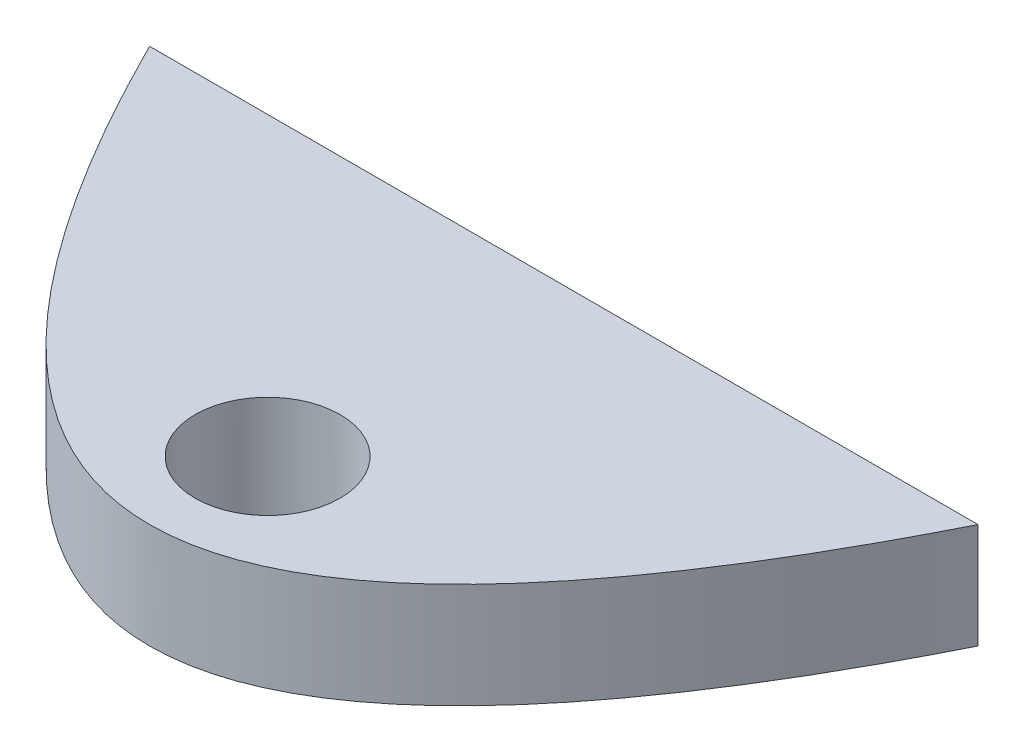
ISO-10303-21;
HEADER;
FILE_DESCRIPTION(('STEP AP214'),'2;1');
FILE_NAME('part.step','',(''),(''),'','','');
FILE_SCHEMA(('AUTOMOTIVE_DESIGN { 1 0 10303 214 1 1 1 1 }'));
ENDSEC;
DATA;
#1=APPLICATION_CONTEXT('core data for automotive mechanical design processes');
#2=APPLICATION_PROTOCOL_DEFINITION('international standard','automotive_design',2000,#1);
#3=PRODUCT_CONTEXT('',#1,'mechanical');
#4=PRODUCT('Part','Part','',(#3));
#5=PRODUCT_RELATED_PRODUCT_CATEGORY('part','',(#4));
#6=PRODUCT_DEFINITION_FORMATION('','',#4);
#7=PRODUCT_DEFINITION_CONTEXT('part definition',#1,'design');
#8=PRODUCT_DEFINITION('design','',#6,#7);
#9=PRODUCT_DEFINITION_SHAPE('','',#8);
#10=(LENGTH_UNIT() NAMED_UNIT(*) SI_UNIT(.MILLI.,.METRE.));
#11=(NAMED_UNIT(*) PLANE_ANGLE_UNIT() SI_UNIT($,.RADIAN.));
#12=(NAMED_UNIT(*) SI_UNIT($,.STERADIAN.) SOLID_ANGLE_UNIT());
#13=UNCERTAINTY_MEASURE_WITH_UNIT(LENGTH_MEASURE(1.E-05),#10,'distance_accuracy_value','');
#14=(GEOMETRIC_REPRESENTATION_CONTEXT(3) GLOBAL_UNCERTAINTY_ASSIGNED_CONTEXT((#13)) GLOBAL_UNIT_ASSIGNED_CONTEXT((#10,
#11,#12)) REPRESENTATION_CONTEXT('',''));
#15=CARTESIAN_POINT('',(0.,0.,0.));
#16=DIRECTION('',(0.,0.,1.));
#17=DIRECTION('',(1.,0.,0.));
#18=AXIS2_PLACEMENT_3D('',#15,#16,#17);
#19=CARTESIAN_POINT('',(-200.000000000337,300.,-6.70196537155832E-10));
#20=CARTESIAN_POINT('',(-5.91540705308091E-11,300.,400.000000000552));
#21=CARTESIAN_POINT('',(200.000000000219,300.,-4.34305369445553E-10));
#22=B_SPLINE_CURVE_WITH_KNOTS('',2,(#19,#20,#21),.UNSPECIFIED.,.F.,.F.,(3,3),(0.056028396232078,
0.943971603767659),.UNSPECIFIED.);
#23=DIRECTION('',(0.,-1.,0.));
#24=VECTOR('',#23,1.);
#25=SURFACE_OF_LINEAR_EXTRUSION('',#22,#24);
#26=DIRECTION('',(0.,-1.,0.));
#27=VECTOR('',#26,1.);
#28=CARTESIAN_POINT('',(-200.00000000027,300.,-5.35238059385865E-10));
#29=LINE('',#28,#27);
#30=CARTESIAN_POINT('',(-200.00000000027,96.8,0.));
#31=VERTEX_POINT('',#30);
#32=CARTESIAN_POINT('',(-200.00000000027,46.,-5.35238059385865E-10));
#33=VERTEX_POINT('',#32);
#34=EDGE_CURVE('E44',#31,#33,#29,.T.);
#35=ORIENTED_EDGE('',*,*,#34,.T.);
#36=CARTESIAN_POINT('',(-200.000000000337,46.,-6.70196537155832E-10));
#37=CARTESIAN_POINT('',(-5.91540705308091E-11,46.,400.000000000552));
#38=CARTESIAN_POINT('',(200.000000000219,46.,-4.34305369445553E-10));
#39=B_SPLINE_CURVE_WITH_KNOTS('',2,(#36,#37,#38),.UNSPECIFIED.,.F.,.F.,(3,3),(0.056028396232078,
0.943971603767659),.UNSPECIFIED.);
#40=CARTESIAN_POINT('',(200.000000000156,46.,0.));
#41=VERTEX_POINT('',#40);
#42=EDGE_CURVE('E51',#33,#41,#39,.T.);
#43=ORIENTED_EDGE('',*,*,#42,.T.);
#44=DIRECTION('',(0.,-1.,0.));
#45=VECTOR('',#44,1.);
#46=CARTESIAN_POINT('',(200.000000000156,300.,-5.35238059385865E-10));
#47=LINE('',#46,#45);
#48=CARTESIAN_POINT('',(200.000000000156,96.8,-5.35238059385865E-10));
#49=VERTEX_POINT('',#48);
#50=EDGE_CURVE('E11',#49,#41,#47,.T.);
#51=ORIENTED_EDGE('',*,*,#50,.F.);
#52=CARTESIAN_POINT('',(-200.000000000337,96.8000000000001,-6.70196537155832E-10));
#53=CARTESIAN_POINT('',(-5.91540705308091E-11,96.8000000000001,400.000000000552));
#54=CARTESIAN_POINT('',(200.000000000219,96.8000000000001,-4.34305369445553E-10));
#55=B_SPLINE_CURVE_WITH_KNOTS('',2,(#52,#53,#54),.UNSPECIFIED.,.F.,.F.,(3,3),(0.056028396232078,
0.943971603767659),.UNSPECIFIED.);
#56=EDGE_CURVE('E58',#49,#31,#55,.F.);
#57=ORIENTED_EDGE('',*,*,#56,.T.);
#58=EDGE_LOOP('',(#35,#43,#51,#57));
#59=FACE_BOUND('',#58,.T.);
#60=ADVANCED_FACE('F35',(#59),#25,.F.);
#61=CARTESIAN_POINT('',(-200.00000000027,300.,-5.35238059385865E-10));
#62=DIRECTION('',(0.,0.,1.));
#63=DIRECTION('',(1.,0.,0.));
#64=AXIS2_PLACEMENT_3D('',#61,#62,#63);
#65=PLANE('',#64);
#66=ORIENTED_EDGE('',*,*,#50,.T.);
#67=DIRECTION('',(1.,0.,0.));
#68=VECTOR('',#67,1.);
#69=CARTESIAN_POINT('',(250.793816506105,46.,0.));
#70=LINE('',#69,#68);
#71=EDGE_CURVE('E69',#33,#41,#70,.T.);
#72=ORIENTED_EDGE('',*,*,#71,.F.);
#73=ORIENTED_EDGE('',*,*,#34,.F.);
#74=DIRECTION('',(-1.,0.,0.));
#75=VECTOR('',#74,1.);
#76=CARTESIAN_POINT('',(245.919301122118,96.8,0.));
#77=LINE('',#76,#75);
#78=EDGE_CURVE('E67',#49,#31,#77,.T.);
#79=ORIENTED_EDGE('',*,*,#78,.F.);
#80=EDGE_LOOP('',(#66,#72,#73,#79));
#81=FACE_BOUND('',#80,.T.);
#82=ADVANCED_FACE('F73',(#81),#65,.F.);
#83=CARTESIAN_POINT('',(0.,-173.,142.999999999465));
#84=DIRECTION('',(0.,1.,0.));
#85=DIRECTION('',(0.,0.,1.));
#86=AXIS2_PLACEMENT_3D('',#83,#84,#85);
#87=CYLINDRICAL_SURFACE('',#86,35.);
#88=CARTESIAN_POINT('',(0.,46.,142.999999999465));
#89=DIRECTION('',(0.,1.,0.));
#90=DIRECTION('',(0.,0.,1.));
#91=AXIS2_PLACEMENT_3D('',#88,#89,#90);
#92=CIRCLE('',#91,35.);
#93=CARTESIAN_POINT('',(0.,46.,177.999999999465));
#94=VERTEX_POINT('',#93);
#95=EDGE_CURVE('E39',#94,#94,#92,.F.);
#96=ORIENTED_EDGE('',*,*,#95,.T.);
#97=EDGE_LOOP('',(#96));
#98=FACE_BOUND('',#97,.T.);
#99=CARTESIAN_POINT('',(0.,96.8,142.999999999465));
#100=DIRECTION('',(0.,-1.,0.));
#101=DIRECTION('',(0.,0.,-1.));
#102=AXIS2_PLACEMENT_3D('',#99,#100,#101);
#103=CIRCLE('',#102,35.);
#104=CARTESIAN_POINT('',(0.,96.8,107.999999999465));
#105=VERTEX_POINT('',#104);
#106=EDGE_CURVE('E74',#105,#105,#103,.F.);
#107=ORIENTED_EDGE('',*,*,#106,.T.);
#108=EDGE_LOOP('',(#107));
#109=FACE_BOUND('',#108,.T.);
#110=ADVANCED_FACE('F97',(#98,#109),#87,.F.);
#111=CARTESIAN_POINT('',(245.919301122118,96.8,200.000000000059));
#112=DIRECTION('',(0.,-1.,0.));
#113=DIRECTION('',(0.,0.,-1.));
#114=AXIS2_PLACEMENT_3D('',#111,#112,#113);
#115=PLANE('',#114);
#116=ORIENTED_EDGE('',*,*,#106,.F.);
#117=EDGE_LOOP('',(#116));
#118=FACE_BOUND('',#117,.T.);
#119=ORIENTED_EDGE('',*,*,#78,.T.);
#120=ORIENTED_EDGE('',*,*,#56,.F.);
#121=EDGE_LOOP('',(#119,#120));
#122=FACE_BOUND('',#121,.T.);
#123=ADVANCED_FACE('F99',(#118,#122),#115,.F.);
#124=CARTESIAN_POINT('',(250.793816506105,46.,200.000000000059));
#125=DIRECTION('',(0.,1.,0.));
#126=DIRECTION('',(0.,0.,1.));
#127=AXIS2_PLACEMENT_3D('',#124,#125,#126);
#128=PLANE('',#127);
#129=ORIENTED_EDGE('',*,*,#95,.F.);
#130=EDGE_LOOP('',(#129));
#131=FACE_BOUND('',#130,.T.);
#132=ORIENTED_EDGE('',*,*,#71,.T.);
#133=ORIENTED_EDGE('',*,*,#42,.F.);
#134=EDGE_LOOP('',(#132,#133));
#135=FACE_BOUND('',#134,.T.);
#136=ADVANCED_FACE('F70',(#131,#135),#128,.F.);
#137=CLOSED_SHELL('',(#60,#82,#110,#123,#136));
#138=MANIFOLD_SOLID_BREP('B2',#137);
#139=ADVANCED_BREP_SHAPE_REPRESENTATION('',(#18,#138),#14);
#140=SHAPE_DEFINITION_REPRESENTATION(#9,#139);
ENDSEC;
END-ISO-10303-21;
